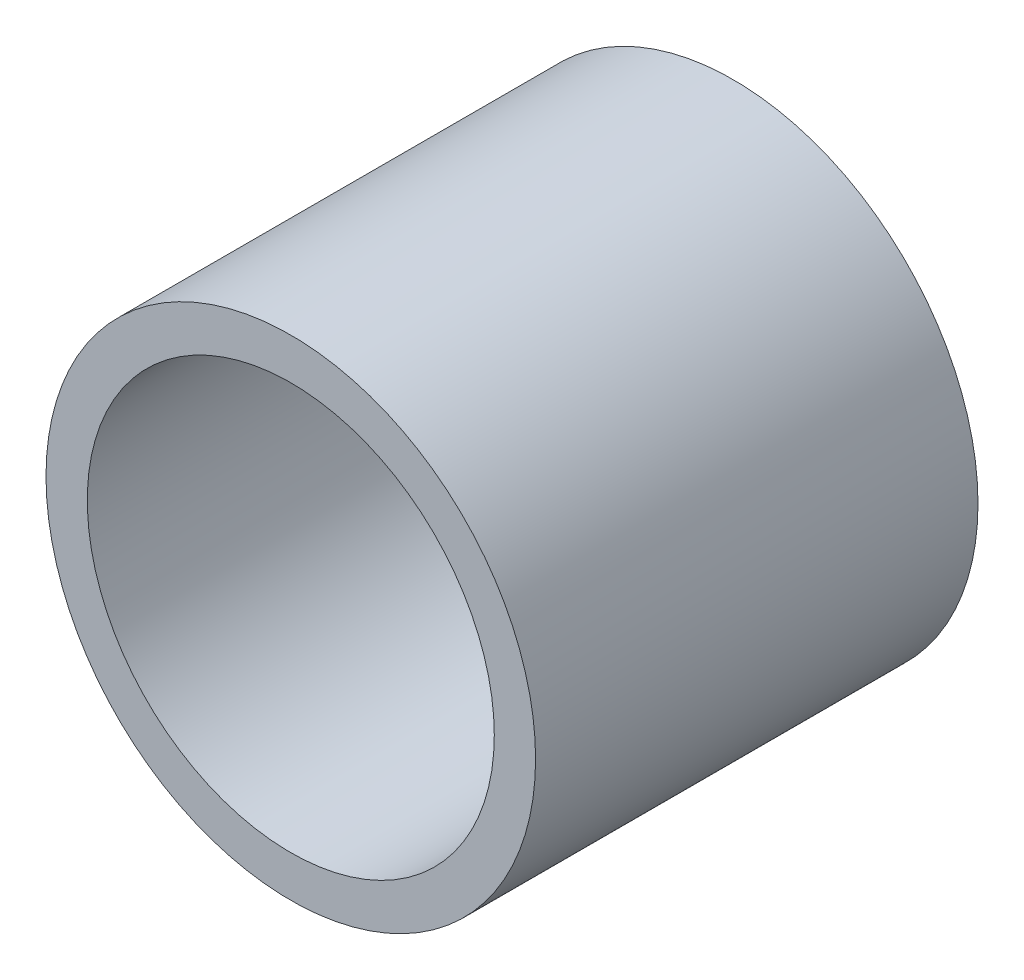
ISO-10303-21;
HEADER;
FILE_DESCRIPTION(('STEP AP214'),'2;1');
FILE_NAME('part.step','',(''),(''),'','','');
FILE_SCHEMA(('AUTOMOTIVE_DESIGN { 1 0 10303 214 1 1 1 1 }'));
ENDSEC;
DATA;
#1=APPLICATION_CONTEXT('core data for automotive mechanical design processes');
#2=APPLICATION_PROTOCOL_DEFINITION('international standard','automotive_design',2000,#1);
#3=PRODUCT_CONTEXT('',#1,'mechanical');
#4=PRODUCT('Part','Part','',(#3));
#5=PRODUCT_RELATED_PRODUCT_CATEGORY('part','',(#4));
#6=PRODUCT_DEFINITION_FORMATION('','',#4);
#7=PRODUCT_DEFINITION_CONTEXT('part definition',#1,'design');
#8=PRODUCT_DEFINITION('design','',#6,#7);
#9=PRODUCT_DEFINITION_SHAPE('','',#8);
#10=(LENGTH_UNIT() NAMED_UNIT(*) SI_UNIT(.MILLI.,.METRE.));
#11=(NAMED_UNIT(*) PLANE_ANGLE_UNIT() SI_UNIT($,.RADIAN.));
#12=(NAMED_UNIT(*) SI_UNIT($,.STERADIAN.) SOLID_ANGLE_UNIT());
#13=UNCERTAINTY_MEASURE_WITH_UNIT(LENGTH_MEASURE(1.E-05),#10,'distance_accuracy_value','');
#14=(GEOMETRIC_REPRESENTATION_CONTEXT(3) GLOBAL_UNCERTAINTY_ASSIGNED_CONTEXT((#13)) GLOBAL_UNIT_ASSIGNED_CONTEXT((#10,
#11,#12)) REPRESENTATION_CONTEXT('',''));
#15=CARTESIAN_POINT('',(0.,0.,0.));
#16=DIRECTION('',(0.,0.,1.));
#17=DIRECTION('',(1.,0.,0.));
#18=AXIS2_PLACEMENT_3D('',#15,#16,#17);
#19=CARTESIAN_POINT('',(0.,0.,19.05));
#20=DIRECTION('',(0.,0.,1.));
#21=DIRECTION('',(1.,0.,0.));
#22=AXIS2_PLACEMENT_3D('',#19,#20,#21);
#23=PLANE('',#22);
#24=CARTESIAN_POINT('',(0.,0.,19.05));
#25=DIRECTION('',(0.,0.,1.));
#26=DIRECTION('',(1.,0.,0.));
#27=AXIS2_PLACEMENT_3D('',#24,#25,#26);
#28=CIRCLE('',#27,21.082);
#29=CARTESIAN_POINT('',(21.082,0.,19.05));
#30=VERTEX_POINT('',#29);
#31=EDGE_CURVE('E11',#30,#30,#28,.T.);
#32=ORIENTED_EDGE('',*,*,#31,.T.);
#33=EDGE_LOOP('',(#32));
#34=FACE_BOUND('',#33,.T.);
#35=CARTESIAN_POINT('',(0.,0.,19.05));
#36=DIRECTION('',(0.,0.,1.));
#37=DIRECTION('',(1.,0.,0.));
#38=AXIS2_PLACEMENT_3D('',#35,#36,#37);
#39=CIRCLE('',#38,17.526);
#40=CARTESIAN_POINT('',(17.526,0.,19.05));
#41=VERTEX_POINT('',#40);
#42=EDGE_CURVE('E48',#41,#41,#39,.T.);
#43=ORIENTED_EDGE('',*,*,#42,.F.);
#44=EDGE_LOOP('',(#43));
#45=FACE_BOUND('',#44,.T.);
#46=ADVANCED_FACE('F37',(#34,#45),#23,.T.);
#47=CARTESIAN_POINT('',(0.,0.,-19.05));
#48=DIRECTION('',(0.,0.,1.));
#49=DIRECTION('',(1.,0.,0.));
#50=AXIS2_PLACEMENT_3D('',#47,#48,#49);
#51=PLANE('',#50);
#52=CARTESIAN_POINT('',(0.,0.,-19.05));
#53=DIRECTION('',(0.,0.,1.));
#54=DIRECTION('',(1.,0.,0.));
#55=AXIS2_PLACEMENT_3D('',#52,#53,#54);
#56=CIRCLE('',#55,21.082);
#57=CARTESIAN_POINT('',(21.082,0.,-19.05));
#58=VERTEX_POINT('',#57);
#59=EDGE_CURVE('E41',#58,#58,#56,.T.);
#60=ORIENTED_EDGE('',*,*,#59,.F.);
#61=EDGE_LOOP('',(#60));
#62=FACE_BOUND('',#61,.T.);
#63=CARTESIAN_POINT('',(0.,0.,-19.05));
#64=DIRECTION('',(0.,0.,1.));
#65=DIRECTION('',(1.,0.,0.));
#66=AXIS2_PLACEMENT_3D('',#63,#64,#65);
#67=CIRCLE('',#66,17.526);
#68=CARTESIAN_POINT('',(17.526,0.,-19.05));
#69=VERTEX_POINT('',#68);
#70=EDGE_CURVE('E50',#69,#69,#67,.T.);
#71=ORIENTED_EDGE('',*,*,#70,.T.);
#72=EDGE_LOOP('',(#71));
#73=FACE_BOUND('',#72,.T.);
#74=ADVANCED_FACE('F60',(#62,#73),#51,.F.);
#75=CARTESIAN_POINT('',(0.,0.,19.05));
#76=DIRECTION('',(0.,0.,-1.));
#77=DIRECTION('',(-1.,0.,0.));
#78=AXIS2_PLACEMENT_3D('',#75,#76,#77);
#79=CYLINDRICAL_SURFACE('',#78,21.082);
#80=ORIENTED_EDGE('',*,*,#31,.F.);
#81=EDGE_LOOP('',(#80));
#82=FACE_BOUND('',#81,.T.);
#83=ORIENTED_EDGE('',*,*,#59,.T.);
#84=EDGE_LOOP('',(#83));
#85=FACE_BOUND('',#84,.T.);
#86=ADVANCED_FACE('F39',(#82,#85),#79,.T.);
#87=CARTESIAN_POINT('',(0.,0.,19.05));
#88=DIRECTION('',(0.,0.,-1.));
#89=DIRECTION('',(-1.,0.,0.));
#90=AXIS2_PLACEMENT_3D('',#87,#88,#89);
#91=CYLINDRICAL_SURFACE('',#90,17.526);
#92=ORIENTED_EDGE('',*,*,#42,.T.);
#93=EDGE_LOOP('',(#92));
#94=FACE_BOUND('',#93,.T.);
#95=ORIENTED_EDGE('',*,*,#70,.F.);
#96=EDGE_LOOP('',(#95));
#97=FACE_BOUND('',#96,.T.);
#98=ADVANCED_FACE('F56',(#94,#97),#91,.F.);
#99=CLOSED_SHELL('',(#46,#74,#86,#98));
#100=MANIFOLD_SOLID_BREP('B2',#99);
#101=ADVANCED_BREP_SHAPE_REPRESENTATION('',(#18,#100),#14);
#102=SHAPE_DEFINITION_REPRESENTATION(#9,#101);
ENDSEC;
END-ISO-10303-21;
